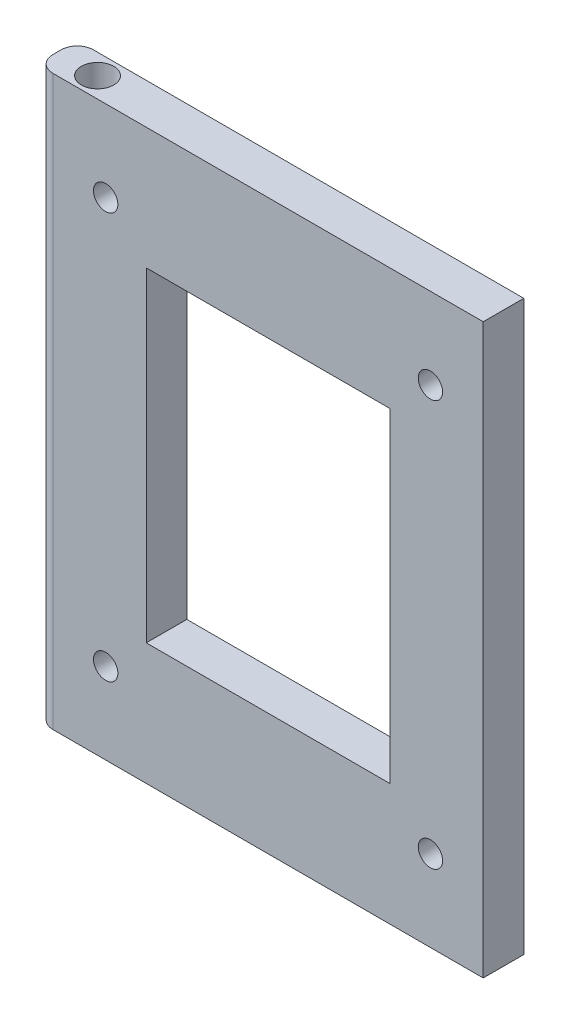
ISO-10303-21;
HEADER;
FILE_DESCRIPTION(('STEP AP214'),'2;1');
FILE_NAME('part.step','',(''),(''),'','','');
FILE_SCHEMA(('AUTOMOTIVE_DESIGN { 1 0 10303 214 1 1 1 1 }'));
ENDSEC;
DATA;
#1=APPLICATION_CONTEXT('core data for automotive mechanical design processes');
#2=APPLICATION_PROTOCOL_DEFINITION('international standard','automotive_design',2000,#1);
#3=PRODUCT_CONTEXT('',#1,'mechanical');
#4=PRODUCT('Part','Part','',(#3));
#5=PRODUCT_RELATED_PRODUCT_CATEGORY('part','',(#4));
#6=PRODUCT_DEFINITION_FORMATION('','',#4);
#7=PRODUCT_DEFINITION_CONTEXT('part definition',#1,'design');
#8=PRODUCT_DEFINITION('design','',#6,#7);
#9=PRODUCT_DEFINITION_SHAPE('','',#8);
#10=(LENGTH_UNIT() NAMED_UNIT(*) SI_UNIT(.MILLI.,.METRE.));
#11=(NAMED_UNIT(*) PLANE_ANGLE_UNIT() SI_UNIT($,.RADIAN.));
#12=(NAMED_UNIT(*) SI_UNIT($,.STERADIAN.) SOLID_ANGLE_UNIT());
#13=UNCERTAINTY_MEASURE_WITH_UNIT(LENGTH_MEASURE(1.E-05),#10,'distance_accuracy_value','');
#14=(GEOMETRIC_REPRESENTATION_CONTEXT(3) GLOBAL_UNCERTAINTY_ASSIGNED_CONTEXT((#13)) GLOBAL_UNIT_ASSIGNED_CONTEXT((#10,
#11,#12)) REPRESENTATION_CONTEXT('',''));
#15=CARTESIAN_POINT('',(0.,0.,0.));
#16=DIRECTION('',(0.,0.,1.));
#17=DIRECTION('',(1.,0.,0.));
#18=AXIS2_PLACEMENT_3D('',#15,#16,#17);
#19=CARTESIAN_POINT('',(0.,0.,5.));
#20=DIRECTION('',(0.,1.,0.));
#21=DIRECTION('',(0.,0.,1.));
#22=AXIS2_PLACEMENT_3D('',#19,#20,#21);
#23=PLANE('',#22);
#24=CARTESIAN_POINT('',(-50.,0.,2.5));
#25=DIRECTION('',(0.,-1.,0.));
#26=DIRECTION('',(0.,0.,-1.));
#27=AXIS2_PLACEMENT_3D('',#24,#25,#26);
#28=CIRCLE('',#27,2.);
#29=CARTESIAN_POINT('',(-50.,0.,0.499999999999997));
#30=VERTEX_POINT('',#29);
#31=EDGE_CURVE('E190',#30,#30,#28,.T.);
#32=ORIENTED_EDGE('',*,*,#31,.F.);
#33=EDGE_LOOP('',(#32));
#34=FACE_BOUND('',#33,.T.);
#35=DIRECTION('',(0.,0.,-1.));
#36=VECTOR('',#35,1.);
#37=CARTESIAN_POINT('',(-55.,0.,5.));
#38=LINE('',#37,#36);
#39=CARTESIAN_POINT('',(-55.,0.,3.));
#40=VERTEX_POINT('',#39);
#41=CARTESIAN_POINT('',(-55.,0.,2.));
#42=VERTEX_POINT('',#41);
#43=EDGE_CURVE('E221',#40,#42,#38,.T.);
#44=ORIENTED_EDGE('',*,*,#43,.T.);
#45=CARTESIAN_POINT('',(-53.,0.,2.));
#46=DIRECTION('',(0.,1.,0.));
#47=DIRECTION('',(0.,0.,1.));
#48=AXIS2_PLACEMENT_3D('',#45,#46,#47);
#49=CIRCLE('',#48,2.);
#50=CARTESIAN_POINT('',(-53.,0.,0.));
#51=VERTEX_POINT('',#50);
#52=EDGE_CURVE('E255',#42,#51,#49,.F.);
#53=ORIENTED_EDGE('',*,*,#52,.T.);
#54=DIRECTION('',(1.,0.,0.));
#55=VECTOR('',#54,1.);
#56=CARTESIAN_POINT('',(0.,0.,0.));
#57=LINE('',#56,#55);
#58=CARTESIAN_POINT('',(0.,0.,0.));
#59=VERTEX_POINT('',#58);
#60=EDGE_CURVE('E206',#51,#59,#57,.T.);
#61=ORIENTED_EDGE('',*,*,#60,.T.);
#62=DIRECTION('',(0.,0.,-1.));
#63=VECTOR('',#62,1.);
#64=CARTESIAN_POINT('',(0.,0.,5.));
#65=LINE('',#64,#63);
#66=CARTESIAN_POINT('',(0.,0.,5.));
#67=VERTEX_POINT('',#66);
#68=EDGE_CURVE('E241',#67,#59,#65,.T.);
#69=ORIENTED_EDGE('',*,*,#68,.F.);
#70=DIRECTION('',(1.,0.,0.));
#71=VECTOR('',#70,1.);
#72=CARTESIAN_POINT('',(0.,0.,5.));
#73=LINE('',#72,#71);
#74=CARTESIAN_POINT('',(-53.,0.,5.));
#75=VERTEX_POINT('',#74);
#76=EDGE_CURVE('E210',#75,#67,#73,.T.);
#77=ORIENTED_EDGE('',*,*,#76,.F.);
#78=CARTESIAN_POINT('',(-53.,0.,3.));
#79=DIRECTION('',(0.,1.,0.));
#80=DIRECTION('',(0.,0.,1.));
#81=AXIS2_PLACEMENT_3D('',#78,#79,#80);
#82=CIRCLE('',#81,2.);
#83=EDGE_CURVE('E252',#75,#40,#82,.F.);
#84=ORIENTED_EDGE('',*,*,#83,.T.);
#85=EDGE_LOOP('',(#44,#53,#61,#69,#77,#84));
#86=FACE_BOUND('',#85,.T.);
#87=ADVANCED_FACE('F45',(#34,#86),#23,.F.);
#88=CARTESIAN_POINT('',(0.,0.,5.));
#89=DIRECTION('',(-1.,0.,0.));
#90=DIRECTION('',(0.,0.,1.));
#91=AXIS2_PLACEMENT_3D('',#88,#89,#90);
#92=PLANE('',#91);
#93=DIRECTION('',(0.,1.,0.));
#94=VECTOR('',#93,1.);
#95=CARTESIAN_POINT('',(0.,0.,0.));
#96=LINE('',#95,#94);
#97=CARTESIAN_POINT('',(0.,70.,0.));
#98=VERTEX_POINT('',#97);
#99=EDGE_CURVE('E224',#59,#98,#96,.T.);
#100=ORIENTED_EDGE('',*,*,#99,.T.);
#101=DIRECTION('',(0.,0.,-1.));
#102=VECTOR('',#101,1.);
#103=CARTESIAN_POINT('',(0.,70.,5.));
#104=LINE('',#103,#102);
#105=CARTESIAN_POINT('',(0.,70.,5.));
#106=VERTEX_POINT('',#105);
#107=EDGE_CURVE('E237',#106,#98,#104,.T.);
#108=ORIENTED_EDGE('',*,*,#107,.F.);
#109=DIRECTION('',(0.,1.,0.));
#110=VECTOR('',#109,1.);
#111=CARTESIAN_POINT('',(0.,0.,5.));
#112=LINE('',#111,#110);
#113=EDGE_CURVE('E213',#67,#106,#112,.T.);
#114=ORIENTED_EDGE('',*,*,#113,.F.);
#115=ORIENTED_EDGE('',*,*,#68,.T.);
#116=EDGE_LOOP('',(#100,#108,#114,#115));
#117=FACE_BOUND('',#116,.T.);
#118=ADVANCED_FACE('F287',(#117),#92,.F.);
#119=CARTESIAN_POINT('',(0.,70.,5.));
#120=DIRECTION('',(0.,-1.,0.));
#121=DIRECTION('',(0.,0.,-1.));
#122=AXIS2_PLACEMENT_3D('',#119,#120,#121);
#123=PLANE('',#122);
#124=CARTESIAN_POINT('',(-50.,70.,2.5));
#125=DIRECTION('',(0.,1.,0.));
#126=DIRECTION('',(0.,0.,1.));
#127=AXIS2_PLACEMENT_3D('',#124,#125,#126);
#128=CIRCLE('',#127,2.);
#129=CARTESIAN_POINT('',(-50.,70.,4.5));
#130=VERTEX_POINT('',#129);
#131=EDGE_CURVE('E198',#130,#130,#128,.T.);
#132=ORIENTED_EDGE('',*,*,#131,.F.);
#133=EDGE_LOOP('',(#132));
#134=FACE_BOUND('',#133,.T.);
#135=DIRECTION('',(-1.,0.,0.));
#136=VECTOR('',#135,1.);
#137=CARTESIAN_POINT('',(0.,70.,0.));
#138=LINE('',#137,#136);
#139=CARTESIAN_POINT('',(-53.,70.,0.));
#140=VERTEX_POINT('',#139);
#141=EDGE_CURVE('E214',#98,#140,#138,.T.);
#142=ORIENTED_EDGE('',*,*,#141,.T.);
#143=CARTESIAN_POINT('',(-53.,70.,2.));
#144=DIRECTION('',(0.,-1.,0.));
#145=DIRECTION('',(0.,0.,-1.));
#146=AXIS2_PLACEMENT_3D('',#143,#144,#145);
#147=CIRCLE('',#146,2.);
#148=CARTESIAN_POINT('',(-55.,70.,2.));
#149=VERTEX_POINT('',#148);
#150=EDGE_CURVE('E54',#140,#149,#147,.F.);
#151=ORIENTED_EDGE('',*,*,#150,.T.);
#152=DIRECTION('',(0.,0.,-1.));
#153=VECTOR('',#152,1.);
#154=CARTESIAN_POINT('',(-55.,70.,5.));
#155=LINE('',#154,#153);
#156=CARTESIAN_POINT('',(-55.,70.,3.));
#157=VERTEX_POINT('',#156);
#158=EDGE_CURVE('E233',#157,#149,#155,.T.);
#159=ORIENTED_EDGE('',*,*,#158,.F.);
#160=CARTESIAN_POINT('',(-53.,70.,3.));
#161=DIRECTION('',(0.,-1.,0.));
#162=DIRECTION('',(0.,0.,-1.));
#163=AXIS2_PLACEMENT_3D('',#160,#161,#162);
#164=CIRCLE('',#163,2.);
#165=CARTESIAN_POINT('',(-53.,70.,5.));
#166=VERTEX_POINT('',#165);
#167=EDGE_CURVE('E261',#157,#166,#164,.F.);
#168=ORIENTED_EDGE('',*,*,#167,.T.);
#169=DIRECTION('',(-1.,0.,0.));
#170=VECTOR('',#169,1.);
#171=CARTESIAN_POINT('',(0.,70.,5.));
#172=LINE('',#171,#170);
#173=EDGE_CURVE('E217',#106,#166,#172,.T.);
#174=ORIENTED_EDGE('',*,*,#173,.F.);
#175=ORIENTED_EDGE('',*,*,#107,.T.);
#176=EDGE_LOOP('',(#142,#151,#159,#168,#174,#175));
#177=FACE_BOUND('',#176,.T.);
#178=ADVANCED_FACE('F267',(#134,#177),#123,.F.);
#179=CARTESIAN_POINT('',(-55.,0.,5.));
#180=DIRECTION('',(1.,0.,0.));
#181=DIRECTION('',(0.,0.,-1.));
#182=AXIS2_PLACEMENT_3D('',#179,#180,#181);
#183=PLANE('',#182);
#184=ORIENTED_EDGE('',*,*,#158,.T.);
#185=DIRECTION('',(0.,-1.,0.));
#186=VECTOR('',#185,1.);
#187=CARTESIAN_POINT('',(-55.,0.,2.));
#188=LINE('',#187,#186);
#189=EDGE_CURVE('E248',#149,#42,#188,.T.);
#190=ORIENTED_EDGE('',*,*,#189,.T.);
#191=ORIENTED_EDGE('',*,*,#43,.F.);
#192=DIRECTION('',(0.,-1.,0.));
#193=VECTOR('',#192,1.);
#194=CARTESIAN_POINT('',(-55.,0.,3.));
#195=LINE('',#194,#193);
#196=EDGE_CURVE('E245',#40,#157,#195,.F.);
#197=ORIENTED_EDGE('',*,*,#196,.T.);
#198=EDGE_LOOP('',(#184,#190,#191,#197));
#199=FACE_BOUND('',#198,.T.);
#200=ADVANCED_FACE('F274',(#199),#183,.F.);
#201=CARTESIAN_POINT('',(0.,0.,5.));
#202=DIRECTION('',(0.,0.,-1.));
#203=DIRECTION('',(-1.,0.,0.));
#204=AXIS2_PLACEMENT_3D('',#201,#202,#203);
#205=PLANE('',#204);
#206=CARTESIAN_POINT('',(-46.5,60.,5.));
#207=DIRECTION('',(0.,0.,1.));
#208=DIRECTION('',(-1.,0.,0.));
#209=AXIS2_PLACEMENT_3D('',#206,#207,#208);
#210=CIRCLE('',#209,1.5);
#211=CARTESIAN_POINT('',(-48.,60.,5.));
#212=VERTEX_POINT('',#211);
#213=EDGE_CURVE('E169',#212,#212,#210,.T.);
#214=ORIENTED_EDGE('',*,*,#213,.F.);
#215=EDGE_LOOP('',(#214));
#216=FACE_BOUND('',#215,.T.);
#217=CARTESIAN_POINT('',(-6.5,10.,5.));
#218=DIRECTION('',(0.,0.,1.));
#219=DIRECTION('',(-1.,0.,0.));
#220=AXIS2_PLACEMENT_3D('',#217,#218,#219);
#221=CIRCLE('',#220,1.5);
#222=CARTESIAN_POINT('',(-8.,10.,5.));
#223=VERTEX_POINT('',#222);
#224=EDGE_CURVE('E178',#223,#223,#221,.T.);
#225=ORIENTED_EDGE('',*,*,#224,.F.);
#226=EDGE_LOOP('',(#225));
#227=FACE_BOUND('',#226,.T.);
#228=CARTESIAN_POINT('',(-46.5,10.,5.));
#229=DIRECTION('',(0.,0.,1.));
#230=DIRECTION('',(1.,0.,0.));
#231=AXIS2_PLACEMENT_3D('',#228,#229,#230);
#232=CIRCLE('',#231,1.5);
#233=CARTESIAN_POINT('',(-45.,10.,5.));
#234=VERTEX_POINT('',#233);
#235=EDGE_CURVE('E152',#234,#234,#232,.T.);
#236=ORIENTED_EDGE('',*,*,#235,.F.);
#237=EDGE_LOOP('',(#236));
#238=FACE_BOUND('',#237,.T.);
#239=DIRECTION('',(-1.,0.,0.));
#240=VECTOR('',#239,1.);
#241=CARTESIAN_POINT('',(-41.5,55.,5.));
#242=LINE('',#241,#240);
#243=CARTESIAN_POINT('',(-11.5,55.,5.));
#244=VERTEX_POINT('',#243);
#245=CARTESIAN_POINT('',(-41.5,55.,5.));
#246=VERTEX_POINT('',#245);
#247=EDGE_CURVE('E145',#244,#246,#242,.T.);
#248=ORIENTED_EDGE('',*,*,#247,.F.);
#249=DIRECTION('',(0.,1.,0.));
#250=VECTOR('',#249,1.);
#251=CARTESIAN_POINT('',(-11.5,15.,5.));
#252=LINE('',#251,#250);
#253=CARTESIAN_POINT('',(-11.5,15.,5.));
#254=VERTEX_POINT('',#253);
#255=EDGE_CURVE('E61',#254,#244,#252,.T.);
#256=ORIENTED_EDGE('',*,*,#255,.F.);
#257=DIRECTION('',(1.,0.,0.));
#258=VECTOR('',#257,1.);
#259=CARTESIAN_POINT('',(-41.5,15.,5.));
#260=LINE('',#259,#258);
#261=CARTESIAN_POINT('',(-41.5,15.,5.));
#262=VERTEX_POINT('',#261);
#263=EDGE_CURVE('E133',#262,#254,#260,.T.);
#264=ORIENTED_EDGE('',*,*,#263,.F.);
#265=DIRECTION('',(0.,-1.,0.));
#266=VECTOR('',#265,1.);
#267=CARTESIAN_POINT('',(-41.5,15.,5.));
#268=LINE('',#267,#266);
#269=EDGE_CURVE('E139',#246,#262,#268,.T.);
#270=ORIENTED_EDGE('',*,*,#269,.F.);
#271=EDGE_LOOP('',(#248,#256,#264,#270));
#272=FACE_BOUND('',#271,.T.);
#273=CARTESIAN_POINT('',(-6.5,60.,5.));
#274=DIRECTION('',(0.,0.,1.));
#275=DIRECTION('',(1.,0.,0.));
#276=AXIS2_PLACEMENT_3D('',#273,#274,#275);
#277=CIRCLE('',#276,1.5);
#278=CARTESIAN_POINT('',(-5.,60.,5.));
#279=VERTEX_POINT('',#278);
#280=EDGE_CURVE('E173',#279,#279,#277,.T.);
#281=ORIENTED_EDGE('',*,*,#280,.F.);
#282=EDGE_LOOP('',(#281));
#283=FACE_BOUND('',#282,.T.);
#284=ORIENTED_EDGE('',*,*,#173,.T.);
#285=DIRECTION('',(0.,-1.,0.));
#286=VECTOR('',#285,1.);
#287=CARTESIAN_POINT('',(-53.,0.,5.));
#288=LINE('',#287,#286);
#289=EDGE_CURVE('E11',#166,#75,#288,.T.);
#290=ORIENTED_EDGE('',*,*,#289,.T.);
#291=ORIENTED_EDGE('',*,*,#76,.T.);
#292=ORIENTED_EDGE('',*,*,#113,.T.);
#293=EDGE_LOOP('',(#284,#290,#291,#292));
#294=FACE_BOUND('',#293,.T.);
#295=ADVANCED_FACE('F142',(#216,#227,#238,#272,#283,#294),#205,.F.);
#296=CARTESIAN_POINT('',(0.,0.,0.));
#297=DIRECTION('',(0.,0.,-1.));
#298=DIRECTION('',(-1.,0.,0.));
#299=AXIS2_PLACEMENT_3D('',#296,#297,#298);
#300=PLANE('',#299);
#301=CARTESIAN_POINT('',(-46.5,60.,0.));
#302=DIRECTION('',(0.,0.,1.));
#303=DIRECTION('',(-1.,0.,0.));
#304=AXIS2_PLACEMENT_3D('',#301,#302,#303);
#305=CIRCLE('',#304,1.5);
#306=CARTESIAN_POINT('',(-48.,60.,0.));
#307=VERTEX_POINT('',#306);
#308=EDGE_CURVE('E174',#307,#307,#305,.T.);
#309=ORIENTED_EDGE('',*,*,#308,.T.);
#310=EDGE_LOOP('',(#309));
#311=FACE_BOUND('',#310,.T.);
#312=CARTESIAN_POINT('',(-6.5,10.,0.));
#313=DIRECTION('',(0.,0.,1.));
#314=DIRECTION('',(-1.,0.,0.));
#315=AXIS2_PLACEMENT_3D('',#312,#313,#314);
#316=CIRCLE('',#315,1.5);
#317=CARTESIAN_POINT('',(-8.,10.,0.));
#318=VERTEX_POINT('',#317);
#319=EDGE_CURVE('E182',#318,#318,#316,.T.);
#320=ORIENTED_EDGE('',*,*,#319,.T.);
#321=EDGE_LOOP('',(#320));
#322=FACE_BOUND('',#321,.T.);
#323=CARTESIAN_POINT('',(-46.5,10.,0.));
#324=DIRECTION('',(0.,0.,1.));
#325=DIRECTION('',(1.,0.,0.));
#326=AXIS2_PLACEMENT_3D('',#323,#324,#325);
#327=CIRCLE('',#326,1.5);
#328=CARTESIAN_POINT('',(-45.,10.,0.));
#329=VERTEX_POINT('',#328);
#330=EDGE_CURVE('E147',#329,#329,#327,.T.);
#331=ORIENTED_EDGE('',*,*,#330,.T.);
#332=EDGE_LOOP('',(#331));
#333=FACE_BOUND('',#332,.T.);
#334=DIRECTION('',(0.,1.,0.));
#335=VECTOR('',#334,1.);
#336=CARTESIAN_POINT('',(-11.5,15.,0.));
#337=LINE('',#336,#335);
#338=CARTESIAN_POINT('',(-11.5,15.,0.));
#339=VERTEX_POINT('',#338);
#340=CARTESIAN_POINT('',(-11.5,55.,0.));
#341=VERTEX_POINT('',#340);
#342=EDGE_CURVE('E125',#339,#341,#337,.T.);
#343=ORIENTED_EDGE('',*,*,#342,.T.);
#344=DIRECTION('',(-1.,0.,0.));
#345=VECTOR('',#344,1.);
#346=CARTESIAN_POINT('',(-41.5,55.,0.));
#347=LINE('',#346,#345);
#348=CARTESIAN_POINT('',(-41.5,55.,0.));
#349=VERTEX_POINT('',#348);
#350=EDGE_CURVE('E163',#341,#349,#347,.T.);
#351=ORIENTED_EDGE('',*,*,#350,.T.);
#352=DIRECTION('',(0.,-1.,0.));
#353=VECTOR('',#352,1.);
#354=CARTESIAN_POINT('',(-41.5,15.,0.));
#355=LINE('',#354,#353);
#356=CARTESIAN_POINT('',(-41.5,15.,0.));
#357=VERTEX_POINT('',#356);
#358=EDGE_CURVE('E69',#349,#357,#355,.T.);
#359=ORIENTED_EDGE('',*,*,#358,.T.);
#360=DIRECTION('',(1.,0.,0.));
#361=VECTOR('',#360,1.);
#362=CARTESIAN_POINT('',(-41.5,15.,0.));
#363=LINE('',#362,#361);
#364=EDGE_CURVE('E157',#357,#339,#363,.T.);
#365=ORIENTED_EDGE('',*,*,#364,.T.);
#366=EDGE_LOOP('',(#343,#351,#359,#365));
#367=FACE_BOUND('',#366,.T.);
#368=CARTESIAN_POINT('',(-6.5,60.,0.));
#369=DIRECTION('',(0.,0.,1.));
#370=DIRECTION('',(1.,0.,0.));
#371=AXIS2_PLACEMENT_3D('',#368,#369,#370);
#372=CIRCLE('',#371,1.5);
#373=CARTESIAN_POINT('',(-5.,60.,0.));
#374=VERTEX_POINT('',#373);
#375=EDGE_CURVE('E186',#374,#374,#372,.T.);
#376=ORIENTED_EDGE('',*,*,#375,.T.);
#377=EDGE_LOOP('',(#376));
#378=FACE_BOUND('',#377,.T.);
#379=ORIENTED_EDGE('',*,*,#60,.F.);
#380=DIRECTION('',(0.,-1.,0.));
#381=VECTOR('',#380,1.);
#382=CARTESIAN_POINT('',(-53.,70.,0.));
#383=LINE('',#382,#381);
#384=EDGE_CURVE('E258',#51,#140,#383,.F.);
#385=ORIENTED_EDGE('',*,*,#384,.T.);
#386=ORIENTED_EDGE('',*,*,#141,.F.);
#387=ORIENTED_EDGE('',*,*,#99,.F.);
#388=EDGE_LOOP('',(#379,#385,#386,#387));
#389=FACE_BOUND('',#388,.T.);
#390=ADVANCED_FACE('F283',(#311,#322,#333,#367,#378,#389),#300,.T.);
#391=CARTESIAN_POINT('',(-50.,65.5,2.5));
#392=DIRECTION('',(0.,1.,0.));
#393=DIRECTION('',(0.,0.,1.));
#394=AXIS2_PLACEMENT_3D('',#391,#392,#393);
#395=CYLINDRICAL_SURFACE('',#394,2.);
#396=CARTESIAN_POINT('',(-50.,65.5,2.5));
#397=DIRECTION('',(0.,1.,0.));
#398=DIRECTION('',(0.,0.,1.));
#399=AXIS2_PLACEMENT_3D('',#396,#397,#398);
#400=CIRCLE('',#399,2.);
#401=CARTESIAN_POINT('',(-50.,65.5,4.5));
#402=VERTEX_POINT('',#401);
#403=EDGE_CURVE('E202',#402,#402,#400,.T.);
#404=ORIENTED_EDGE('',*,*,#403,.F.);
#405=EDGE_LOOP('',(#404));
#406=FACE_BOUND('',#405,.T.);
#407=ORIENTED_EDGE('',*,*,#131,.T.);
#408=EDGE_LOOP('',(#407));
#409=FACE_BOUND('',#408,.T.);
#410=ADVANCED_FACE('F320',(#406,#409),#395,.F.);
#411=CARTESIAN_POINT('',(-50.,65.5,2.5));
#412=DIRECTION('',(0.,1.,0.));
#413=DIRECTION('',(0.,0.,1.));
#414=AXIS2_PLACEMENT_3D('',#411,#412,#413);
#415=PLANE('',#414);
#416=ORIENTED_EDGE('',*,*,#403,.T.);
#417=EDGE_LOOP('',(#416));
#418=FACE_BOUND('',#417,.T.);
#419=ADVANCED_FACE('F326',(#418),#415,.T.);
#420=CARTESIAN_POINT('',(-50.,4.5,2.5));
#421=DIRECTION('',(0.,-1.,0.));
#422=DIRECTION('',(0.,0.,-1.));
#423=AXIS2_PLACEMENT_3D('',#420,#421,#422);
#424=CYLINDRICAL_SURFACE('',#423,2.);
#425=CARTESIAN_POINT('',(-50.,4.5,2.5));
#426=DIRECTION('',(0.,-1.,0.));
#427=DIRECTION('',(0.,0.,-1.));
#428=AXIS2_PLACEMENT_3D('',#425,#426,#427);
#429=CIRCLE('',#428,2.);
#430=CARTESIAN_POINT('',(-50.,4.5,0.499999999999997));
#431=VERTEX_POINT('',#430);
#432=EDGE_CURVE('E194',#431,#431,#429,.T.);
#433=ORIENTED_EDGE('',*,*,#432,.F.);
#434=EDGE_LOOP('',(#433));
#435=FACE_BOUND('',#434,.T.);
#436=ORIENTED_EDGE('',*,*,#31,.T.);
#437=EDGE_LOOP('',(#436));
#438=FACE_BOUND('',#437,.T.);
#439=ADVANCED_FACE('F330',(#435,#438),#424,.F.);
#440=CARTESIAN_POINT('',(-50.,4.5,2.5));
#441=DIRECTION('',(0.,-1.,0.));
#442=DIRECTION('',(0.,0.,-1.));
#443=AXIS2_PLACEMENT_3D('',#440,#441,#442);
#444=PLANE('',#443);
#445=ORIENTED_EDGE('',*,*,#432,.T.);
#446=EDGE_LOOP('',(#445));
#447=FACE_BOUND('',#446,.T.);
#448=ADVANCED_FACE('F302',(#447),#444,.T.);
#449=CARTESIAN_POINT('',(-53.,0.,2.));
#450=DIRECTION('',(0.,1.,0.));
#451=DIRECTION('',(0.,0.,1.));
#452=AXIS2_PLACEMENT_3D('',#449,#450,#451);
#453=CYLINDRICAL_SURFACE('',#452,2.);
#454=ORIENTED_EDGE('',*,*,#150,.F.);
#455=ORIENTED_EDGE('',*,*,#384,.F.);
#456=ORIENTED_EDGE('',*,*,#52,.F.);
#457=ORIENTED_EDGE('',*,*,#189,.F.);
#458=EDGE_LOOP('',(#454,#455,#456,#457));
#459=FACE_BOUND('',#458,.T.);
#460=ADVANCED_FACE('F277',(#459),#453,.T.);
#461=CARTESIAN_POINT('',(-53.,0.,3.));
#462=DIRECTION('',(0.,-1.,0.));
#463=DIRECTION('',(0.,0.,-1.));
#464=AXIS2_PLACEMENT_3D('',#461,#462,#463);
#465=CYLINDRICAL_SURFACE('',#464,2.);
#466=ORIENTED_EDGE('',*,*,#167,.F.);
#467=ORIENTED_EDGE('',*,*,#196,.F.);
#468=ORIENTED_EDGE('',*,*,#83,.F.);
#469=ORIENTED_EDGE('',*,*,#289,.F.);
#470=EDGE_LOOP('',(#466,#467,#468,#469));
#471=FACE_BOUND('',#470,.T.);
#472=ADVANCED_FACE('F47',(#471),#465,.T.);
#473=CARTESIAN_POINT('',(-6.5,60.,0.));
#474=DIRECTION('',(0.,0.,1.));
#475=DIRECTION('',(1.,0.,0.));
#476=AXIS2_PLACEMENT_3D('',#473,#474,#475);
#477=CYLINDRICAL_SURFACE('',#476,1.5);
#478=ORIENTED_EDGE('',*,*,#375,.F.);
#479=EDGE_LOOP('',(#478));
#480=FACE_BOUND('',#479,.T.);
#481=ORIENTED_EDGE('',*,*,#280,.T.);
#482=EDGE_LOOP('',(#481));
#483=FACE_BOUND('',#482,.T.);
#484=ADVANCED_FACE('F294',(#480,#483),#477,.F.);
#485=CARTESIAN_POINT('',(-11.5,15.,0.));
#486=DIRECTION('',(1.,0.,0.));
#487=DIRECTION('',(0.,0.,-1.));
#488=AXIS2_PLACEMENT_3D('',#485,#486,#487);
#489=PLANE('',#488);
#490=ORIENTED_EDGE('',*,*,#255,.T.);
#491=DIRECTION('',(0.,0.,1.));
#492=VECTOR('',#491,1.);
#493=CARTESIAN_POINT('',(-11.5,55.,0.));
#494=LINE('',#493,#492);
#495=EDGE_CURVE('E160',#341,#244,#494,.T.);
#496=ORIENTED_EDGE('',*,*,#495,.F.);
#497=ORIENTED_EDGE('',*,*,#342,.F.);
#498=DIRECTION('',(0.,0.,1.));
#499=VECTOR('',#498,1.);
#500=CARTESIAN_POINT('',(-11.5,15.,0.));
#501=LINE('',#500,#499);
#502=EDGE_CURVE('E121',#339,#254,#501,.T.);
#503=ORIENTED_EDGE('',*,*,#502,.T.);
#504=EDGE_LOOP('',(#490,#496,#497,#503));
#505=FACE_BOUND('',#504,.T.);
#506=ADVANCED_FACE('F123',(#505),#489,.F.);
#507=CARTESIAN_POINT('',(-41.5,15.,0.));
#508=DIRECTION('',(0.,-1.,0.));
#509=DIRECTION('',(0.,0.,-1.));
#510=AXIS2_PLACEMENT_3D('',#507,#508,#509);
#511=PLANE('',#510);
#512=ORIENTED_EDGE('',*,*,#263,.T.);
#513=ORIENTED_EDGE('',*,*,#502,.F.);
#514=ORIENTED_EDGE('',*,*,#364,.F.);
#515=DIRECTION('',(0.,0.,1.));
#516=VECTOR('',#515,1.);
#517=CARTESIAN_POINT('',(-41.5,15.,0.));
#518=LINE('',#517,#516);
#519=EDGE_CURVE('E130',#357,#262,#518,.T.);
#520=ORIENTED_EDGE('',*,*,#519,.T.);
#521=EDGE_LOOP('',(#512,#513,#514,#520));
#522=FACE_BOUND('',#521,.T.);
#523=ADVANCED_FACE('F134',(#522),#511,.F.);
#524=CARTESIAN_POINT('',(-41.5,15.,0.));
#525=DIRECTION('',(-1.,0.,0.));
#526=DIRECTION('',(0.,0.,1.));
#527=AXIS2_PLACEMENT_3D('',#524,#525,#526);
#528=PLANE('',#527);
#529=ORIENTED_EDGE('',*,*,#269,.T.);
#530=ORIENTED_EDGE('',*,*,#519,.F.);
#531=ORIENTED_EDGE('',*,*,#358,.F.);
#532=DIRECTION('',(0.,0.,1.));
#533=VECTOR('',#532,1.);
#534=CARTESIAN_POINT('',(-41.5,55.,0.));
#535=LINE('',#534,#533);
#536=EDGE_CURVE('E371',#349,#246,#535,.T.);
#537=ORIENTED_EDGE('',*,*,#536,.T.);
#538=EDGE_LOOP('',(#529,#530,#531,#537));
#539=FACE_BOUND('',#538,.T.);
#540=ADVANCED_FACE('F348',(#539),#528,.F.);
#541=CARTESIAN_POINT('',(-41.5,55.,0.));
#542=DIRECTION('',(0.,1.,0.));
#543=DIRECTION('',(0.,0.,1.));
#544=AXIS2_PLACEMENT_3D('',#541,#542,#543);
#545=PLANE('',#544);
#546=ORIENTED_EDGE('',*,*,#247,.T.);
#547=ORIENTED_EDGE('',*,*,#536,.F.);
#548=ORIENTED_EDGE('',*,*,#350,.F.);
#549=ORIENTED_EDGE('',*,*,#495,.T.);
#550=EDGE_LOOP('',(#546,#547,#548,#549));
#551=FACE_BOUND('',#550,.T.);
#552=ADVANCED_FACE('F351',(#551),#545,.F.);
#553=CARTESIAN_POINT('',(-46.5,10.,0.));
#554=DIRECTION('',(0.,0.,1.));
#555=DIRECTION('',(1.,0.,0.));
#556=AXIS2_PLACEMENT_3D('',#553,#554,#555);
#557=CYLINDRICAL_SURFACE('',#556,1.5);
#558=ORIENTED_EDGE('',*,*,#330,.F.);
#559=EDGE_LOOP('',(#558));
#560=FACE_BOUND('',#559,.T.);
#561=ORIENTED_EDGE('',*,*,#235,.T.);
#562=EDGE_LOOP('',(#561));
#563=FACE_BOUND('',#562,.T.);
#564=ADVANCED_FACE('F341',(#560,#563),#557,.F.);
#565=CARTESIAN_POINT('',(-6.5,10.,0.));
#566=DIRECTION('',(0.,0.,1.));
#567=DIRECTION('',(1.,0.,0.));
#568=AXIS2_PLACEMENT_3D('',#565,#566,#567);
#569=CYLINDRICAL_SURFACE('',#568,1.5);
#570=ORIENTED_EDGE('',*,*,#319,.F.);
#571=EDGE_LOOP('',(#570));
#572=FACE_BOUND('',#571,.T.);
#573=ORIENTED_EDGE('',*,*,#224,.T.);
#574=EDGE_LOOP('',(#573));
#575=FACE_BOUND('',#574,.T.);
#576=ADVANCED_FACE('F337',(#572,#575),#569,.F.);
#577=CARTESIAN_POINT('',(-46.5,60.,0.));
#578=DIRECTION('',(0.,0.,1.));
#579=DIRECTION('',(1.,0.,0.));
#580=AXIS2_PLACEMENT_3D('',#577,#578,#579);
#581=CYLINDRICAL_SURFACE('',#580,1.5);
#582=ORIENTED_EDGE('',*,*,#308,.F.);
#583=EDGE_LOOP('',(#582));
#584=FACE_BOUND('',#583,.T.);
#585=ORIENTED_EDGE('',*,*,#213,.T.);
#586=EDGE_LOOP('',(#585));
#587=FACE_BOUND('',#586,.T.);
#588=ADVANCED_FACE('F340',(#584,#587),#581,.F.);
#589=CLOSED_SHELL('',(#87,#118,#178,#200,#295,#390,#410,#419,#439,#448,#460,#472,#484,#506,#523,
#540,#552,#564,#576,#588));
#590=MANIFOLD_SOLID_BREP('B2',#589);
#591=ADVANCED_BREP_SHAPE_REPRESENTATION('',(#18,#590),#14);
#592=SHAPE_DEFINITION_REPRESENTATION(#9,#591);
ENDSEC;
END-ISO-10303-21;
